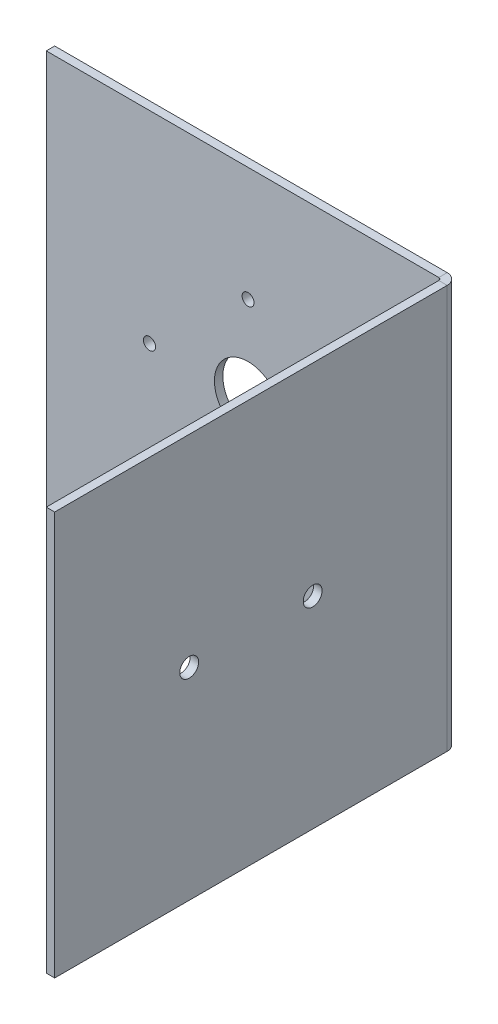
ISO-10303-21;
HEADER;
FILE_DESCRIPTION(('STEP AP214'),'2;1');
FILE_NAME('part.step','',(''),(''),'','','');
FILE_SCHEMA(('AUTOMOTIVE_DESIGN { 1 0 10303 214 1 1 1 1 }'));
ENDSEC;
DATA;
#1=APPLICATION_CONTEXT('core data for automotive mechanical design processes');
#2=APPLICATION_PROTOCOL_DEFINITION('international standard','automotive_design',2000,#1);
#3=PRODUCT_CONTEXT('',#1,'mechanical');
#4=PRODUCT('Part','Part','',(#3));
#5=PRODUCT_RELATED_PRODUCT_CATEGORY('part','',(#4));
#6=PRODUCT_DEFINITION_FORMATION('','',#4);
#7=PRODUCT_DEFINITION_CONTEXT('part definition',#1,'design');
#8=PRODUCT_DEFINITION('design','',#6,#7);
#9=PRODUCT_DEFINITION_SHAPE('','',#8);
#10=(LENGTH_UNIT() NAMED_UNIT(*) SI_UNIT(.MILLI.,.METRE.));
#11=(NAMED_UNIT(*) PLANE_ANGLE_UNIT() SI_UNIT($,.RADIAN.));
#12=(NAMED_UNIT(*) SI_UNIT($,.STERADIAN.) SOLID_ANGLE_UNIT());
#13=UNCERTAINTY_MEASURE_WITH_UNIT(LENGTH_MEASURE(1.E-05),#10,'distance_accuracy_value','');
#14=(GEOMETRIC_REPRESENTATION_CONTEXT(3) GLOBAL_UNCERTAINTY_ASSIGNED_CONTEXT((#13)) GLOBAL_UNIT_ASSIGNED_CONTEXT((#10,
#11,#12)) REPRESENTATION_CONTEXT('',''));
#15=CARTESIAN_POINT('',(0.,0.,0.));
#16=DIRECTION('',(0.,0.,1.));
#17=DIRECTION('',(1.,0.,0.));
#18=AXIS2_PLACEMENT_3D('',#15,#16,#17);
#19=CARTESIAN_POINT('',(0.,76.2,4.175));
#20=DIRECTION('',(0.,1.,0.));
#21=DIRECTION('',(0.,0.,1.));
#22=AXIS2_PLACEMENT_3D('',#19,#20,#21);
#23=PLANE('',#22);
#24=DIRECTION('',(-1.,0.,0.));
#25=VECTOR('',#24,1.);
#26=CARTESIAN_POINT('',(0.,76.2,4.175));
#27=LINE('',#26,#25);
#28=CARTESIAN_POINT('',(0.,76.2,4.175));
#29=VERTEX_POINT('',#28);
#30=CARTESIAN_POINT('',(-3.175,76.2,4.175));
#31=VERTEX_POINT('',#30);
#32=EDGE_CURVE('E11',#29,#31,#27,.T.);
#33=ORIENTED_EDGE('',*,*,#32,.F.);
#34=CARTESIAN_POINT('',(-4.17500000000003,76.2,4.175));
#35=DIRECTION('',(0.,1.,0.));
#36=DIRECTION('',(0.,0.,1.));
#37=AXIS2_PLACEMENT_3D('',#34,#35,#36);
#38=CIRCLE('',#37,4.175);
#39=CARTESIAN_POINT('',(-4.17500000000015,76.2,0.));
#40=VERTEX_POINT('',#39);
#41=EDGE_CURVE('E136',#40,#29,#38,.F.);
#42=ORIENTED_EDGE('',*,*,#41,.F.);
#43=DIRECTION('',(0.,0.,-1.));
#44=VECTOR('',#43,1.);
#45=CARTESIAN_POINT('',(-4.17500000000006,76.2,3.175));
#46=LINE('',#45,#44);
#47=CARTESIAN_POINT('',(-4.17500000000006,76.2,3.175));
#48=VERTEX_POINT('',#47);
#49=EDGE_CURVE('E47',#48,#40,#46,.T.);
#50=ORIENTED_EDGE('',*,*,#49,.F.);
#51=CARTESIAN_POINT('',(-4.17500000000003,76.2,4.175));
#52=DIRECTION('',(0.,1.,0.));
#53=DIRECTION('',(1.,0.,0.));
#54=AXIS2_PLACEMENT_3D('',#51,#52,#53);
#55=CIRCLE('',#54,1.);
#56=EDGE_CURVE('E129',#48,#31,#55,.F.);
#57=ORIENTED_EDGE('',*,*,#56,.T.);
#58=EDGE_LOOP('',(#33,#42,#50,#57));
#59=FACE_BOUND('',#58,.T.);
#60=ADVANCED_FACE('F39',(#59),#23,.T.);
#61=CARTESIAN_POINT('',(-4.17500000000006,76.2,3.175));
#62=DIRECTION('',(0.,1.,0.));
#63=DIRECTION('',(0.,0.,1.));
#64=AXIS2_PLACEMENT_3D('',#61,#62,#63);
#65=PLANE('',#64);
#66=DIRECTION('',(0.,0.,1.));
#67=VECTOR('',#66,1.);
#68=CARTESIAN_POINT('',(0.,76.2,0.));
#69=LINE('',#68,#67);
#70=CARTESIAN_POINT('',(0.,76.2,152.4));
#71=VERTEX_POINT('',#70);
#72=EDGE_CURVE('E186',#29,#71,#69,.T.);
#73=ORIENTED_EDGE('',*,*,#72,.F.);
#74=ORIENTED_EDGE('',*,*,#32,.T.);
#75=DIRECTION('',(0.,0.,1.));
#76=VECTOR('',#75,1.);
#77=CARTESIAN_POINT('',(-3.175,76.2,0.));
#78=LINE('',#77,#76);
#79=CARTESIAN_POINT('',(-3.17499999999998,76.2,152.4));
#80=VERTEX_POINT('',#79);
#81=EDGE_CURVE('E95',#31,#80,#78,.T.);
#82=ORIENTED_EDGE('',*,*,#81,.T.);
#83=DIRECTION('',(-1.,0.,0.));
#84=VECTOR('',#83,1.);
#85=CARTESIAN_POINT('',(0.,76.2,152.4));
#86=LINE('',#85,#84);
#87=EDGE_CURVE('E454',#71,#80,#86,.T.);
#88=ORIENTED_EDGE('',*,*,#87,.F.);
#89=EDGE_LOOP('',(#73,#74,#82,#88));
#90=FACE_BOUND('',#89,.T.);
#91=ADVANCED_FACE('F194',(#90),#65,.T.);
#92=CARTESIAN_POINT('',(-4.17500000000015,-76.2,0.));
#93=DIRECTION('',(0.,-1.,0.));
#94=DIRECTION('',(0.,0.,-1.));
#95=AXIS2_PLACEMENT_3D('',#92,#93,#94);
#96=PLANE('',#95);
#97=DIRECTION('',(0.,0.,1.));
#98=VECTOR('',#97,1.);
#99=CARTESIAN_POINT('',(-4.17500000000015,-76.2,0.));
#100=LINE('',#99,#98);
#101=CARTESIAN_POINT('',(-4.17500000000015,-76.2,0.));
#102=VERTEX_POINT('',#101);
#103=CARTESIAN_POINT('',(-4.17500000000006,-76.2,3.175));
#104=VERTEX_POINT('',#103);
#105=EDGE_CURVE('E82',#102,#104,#100,.T.);
#106=ORIENTED_EDGE('',*,*,#105,.F.);
#107=CARTESIAN_POINT('',(-4.17500000000003,-76.2,4.175));
#108=DIRECTION('',(0.,1.,0.));
#109=DIRECTION('',(0.,0.,1.));
#110=AXIS2_PLACEMENT_3D('',#107,#108,#109);
#111=CIRCLE('',#110,4.175);
#112=CARTESIAN_POINT('',(0.,-76.2,4.175));
#113=VERTEX_POINT('',#112);
#114=EDGE_CURVE('E152',#102,#113,#111,.F.);
#115=ORIENTED_EDGE('',*,*,#114,.T.);
#116=DIRECTION('',(1.,0.,0.));
#117=VECTOR('',#116,1.);
#118=CARTESIAN_POINT('',(-3.175,-76.2,4.175));
#119=LINE('',#118,#117);
#120=CARTESIAN_POINT('',(-3.175,-76.2,4.175));
#121=VERTEX_POINT('',#120);
#122=EDGE_CURVE('E89',#121,#113,#119,.T.);
#123=ORIENTED_EDGE('',*,*,#122,.F.);
#124=CARTESIAN_POINT('',(-4.17500000000003,-76.2,4.175));
#125=DIRECTION('',(0.,1.,0.));
#126=DIRECTION('',(1.,0.,0.));
#127=AXIS2_PLACEMENT_3D('',#124,#125,#126);
#128=CIRCLE('',#127,1.);
#129=EDGE_CURVE('E159',#104,#121,#128,.F.);
#130=ORIENTED_EDGE('',*,*,#129,.F.);
#131=EDGE_LOOP('',(#106,#115,#123,#130));
#132=FACE_BOUND('',#131,.T.);
#133=ADVANCED_FACE('F192',(#132),#96,.T.);
#134=CARTESIAN_POINT('',(-3.175,-76.2,4.175));
#135=DIRECTION('',(0.,-1.,0.));
#136=DIRECTION('',(0.,0.,-1.));
#137=AXIS2_PLACEMENT_3D('',#134,#135,#136);
#138=PLANE('',#137);
#139=DIRECTION('',(1.,0.,0.));
#140=VECTOR('',#139,1.);
#141=CARTESIAN_POINT('',(-152.4,-76.2,0.));
#142=LINE('',#141,#140);
#143=CARTESIAN_POINT('',(-152.4,-76.2,0.));
#144=VERTEX_POINT('',#143);
#145=EDGE_CURVE('E154',#144,#102,#142,.T.);
#146=ORIENTED_EDGE('',*,*,#145,.T.);
#147=ORIENTED_EDGE('',*,*,#105,.T.);
#148=DIRECTION('',(1.,0.,0.));
#149=VECTOR('',#148,1.);
#150=CARTESIAN_POINT('',(-152.4,-76.2,3.175));
#151=LINE('',#150,#149);
#152=CARTESIAN_POINT('',(-152.4,-76.2,3.175));
#153=VERTEX_POINT('',#152);
#154=EDGE_CURVE('E157',#153,#104,#151,.T.);
#155=ORIENTED_EDGE('',*,*,#154,.F.);
#156=DIRECTION('',(0.,0.,-1.));
#157=VECTOR('',#156,1.);
#158=CARTESIAN_POINT('',(-152.4,-76.2,3.175));
#159=LINE('',#158,#157);
#160=EDGE_CURVE('E117',#153,#144,#159,.T.);
#161=ORIENTED_EDGE('',*,*,#160,.T.);
#162=EDGE_LOOP('',(#146,#147,#155,#161));
#163=FACE_BOUND('',#162,.T.);
#164=ADVANCED_FACE('F188',(#163),#138,.T.);
#165=CARTESIAN_POINT('',(-3.175,76.2,0.));
#166=DIRECTION('',(1.,0.,0.));
#167=DIRECTION('',(0.,0.,-1.));
#168=AXIS2_PLACEMENT_3D('',#165,#166,#167);
#169=PLANE('',#168);
#170=CARTESIAN_POINT('',(-3.17500000000004,0.,101.6));
#171=DIRECTION('',(1.,0.,0.));
#172=DIRECTION('',(0.,0.,-1.));
#173=AXIS2_PLACEMENT_3D('',#170,#171,#172);
#174=CIRCLE('',#173,3.55600000000001);
#175=CARTESIAN_POINT('',(-3.17500000000004,0.,98.044));
#176=VERTEX_POINT('',#175);
#177=EDGE_CURVE('E420',#176,#176,#174,.T.);
#178=ORIENTED_EDGE('',*,*,#177,.T.);
#179=EDGE_LOOP('',(#178));
#180=FACE_BOUND('',#179,.T.);
#181=CARTESIAN_POINT('',(-3.17500000000004,0.,54.975));
#182=DIRECTION('',(1.,0.,0.));
#183=DIRECTION('',(0.,0.,-1.));
#184=AXIS2_PLACEMENT_3D('',#181,#182,#183);
#185=CIRCLE('',#184,3.556);
#186=CARTESIAN_POINT('',(-3.17500000000004,0.,51.419));
#187=VERTEX_POINT('',#186);
#188=EDGE_CURVE('E424',#187,#187,#185,.T.);
#189=ORIENTED_EDGE('',*,*,#188,.T.);
#190=EDGE_LOOP('',(#189));
#191=FACE_BOUND('',#190,.T.);
#192=DIRECTION('',(0.,0.,1.));
#193=VECTOR('',#192,1.);
#194=CARTESIAN_POINT('',(-3.175,-76.2,0.));
#195=LINE('',#194,#193);
#196=CARTESIAN_POINT('',(-3.17499999999998,-76.2,152.4));
#197=VERTEX_POINT('',#196);
#198=EDGE_CURVE('E142',#121,#197,#195,.T.);
#199=ORIENTED_EDGE('',*,*,#198,.T.);
#200=DIRECTION('',(0.,-1.,0.));
#201=VECTOR('',#200,1.);
#202=CARTESIAN_POINT('',(-3.17499999999998,76.2,152.4));
#203=LINE('',#202,#201);
#204=EDGE_CURVE('E173',#80,#197,#203,.T.);
#205=ORIENTED_EDGE('',*,*,#204,.F.);
#206=ORIENTED_EDGE('',*,*,#81,.F.);
#207=DIRECTION('',(0.,-1.,0.));
#208=VECTOR('',#207,1.);
#209=CARTESIAN_POINT('',(-3.175,76.2,4.175));
#210=LINE('',#209,#208);
#211=EDGE_CURVE('E141',#31,#121,#210,.T.);
#212=ORIENTED_EDGE('',*,*,#211,.T.);
#213=EDGE_LOOP('',(#199,#205,#206,#212));
#214=FACE_BOUND('',#213,.T.);
#215=ADVANCED_FACE('F200',(#180,#191,#214),#169,.F.);
#216=CARTESIAN_POINT('',(0.,76.2,152.4));
#217=DIRECTION('',(0.,0.,1.));
#218=DIRECTION('',(1.,0.,0.));
#219=AXIS2_PLACEMENT_3D('',#216,#217,#218);
#220=PLANE('',#219);
#221=DIRECTION('',(-1.,0.,0.));
#222=VECTOR('',#221,1.);
#223=CARTESIAN_POINT('',(0.,-76.2,152.4));
#224=LINE('',#223,#222);
#225=CARTESIAN_POINT('',(0.,-76.2,152.4));
#226=VERTEX_POINT('',#225);
#227=EDGE_CURVE('E145',#226,#197,#224,.T.);
#228=ORIENTED_EDGE('',*,*,#227,.F.);
#229=DIRECTION('',(0.,-1.,0.));
#230=VECTOR('',#229,1.);
#231=CARTESIAN_POINT('',(0.,76.2,152.4));
#232=LINE('',#231,#230);
#233=EDGE_CURVE('E171',#71,#226,#232,.T.);
#234=ORIENTED_EDGE('',*,*,#233,.F.);
#235=ORIENTED_EDGE('',*,*,#87,.T.);
#236=ORIENTED_EDGE('',*,*,#204,.T.);
#237=EDGE_LOOP('',(#228,#234,#235,#236));
#238=FACE_BOUND('',#237,.T.);
#239=ADVANCED_FACE('F229',(#238),#220,.T.);
#240=CARTESIAN_POINT('',(0.,76.2,0.));
#241=DIRECTION('',(1.,0.,0.));
#242=DIRECTION('',(0.,0.,-1.));
#243=AXIS2_PLACEMENT_3D('',#240,#241,#242);
#244=PLANE('',#243);
#245=CARTESIAN_POINT('',(0.,0.,101.6));
#246=DIRECTION('',(1.,0.,0.));
#247=DIRECTION('',(0.,0.,1.));
#248=AXIS2_PLACEMENT_3D('',#245,#246,#247);
#249=CIRCLE('',#248,3.55600000000001);
#250=CARTESIAN_POINT('',(0.,0.,105.156));
#251=VERTEX_POINT('',#250);
#252=EDGE_CURVE('E417',#251,#251,#249,.T.);
#253=ORIENTED_EDGE('',*,*,#252,.F.);
#254=EDGE_LOOP('',(#253));
#255=FACE_BOUND('',#254,.T.);
#256=CARTESIAN_POINT('',(0.,0.,54.975));
#257=DIRECTION('',(1.,0.,0.));
#258=DIRECTION('',(0.,0.,-1.));
#259=AXIS2_PLACEMENT_3D('',#256,#257,#258);
#260=CIRCLE('',#259,3.556);
#261=CARTESIAN_POINT('',(0.,0.,51.419));
#262=VERTEX_POINT('',#261);
#263=EDGE_CURVE('E421',#262,#262,#260,.T.);
#264=ORIENTED_EDGE('',*,*,#263,.F.);
#265=EDGE_LOOP('',(#264));
#266=FACE_BOUND('',#265,.T.);
#267=DIRECTION('',(0.,0.,1.));
#268=VECTOR('',#267,1.);
#269=CARTESIAN_POINT('',(0.,-76.2,0.));
#270=LINE('',#269,#268);
#271=EDGE_CURVE('E149',#113,#226,#270,.T.);
#272=ORIENTED_EDGE('',*,*,#271,.F.);
#273=DIRECTION('',(0.,-1.,0.));
#274=VECTOR('',#273,1.);
#275=CARTESIAN_POINT('',(0.,76.2,4.175));
#276=LINE('',#275,#274);
#277=EDGE_CURVE('E168',#29,#113,#276,.T.);
#278=ORIENTED_EDGE('',*,*,#277,.F.);
#279=ORIENTED_EDGE('',*,*,#72,.T.);
#280=ORIENTED_EDGE('',*,*,#233,.T.);
#281=EDGE_LOOP('',(#272,#278,#279,#280));
#282=FACE_BOUND('',#281,.T.);
#283=ADVANCED_FACE('F234',(#255,#266,#282),#244,.T.);
#284=CARTESIAN_POINT('',(-4.17500000000003,76.2,4.175));
#285=DIRECTION('',(0.,-1.,0.));
#286=DIRECTION('',(0.,0.,-1.));
#287=AXIS2_PLACEMENT_3D('',#284,#285,#286);
#288=CYLINDRICAL_SURFACE('',#287,4.175);
#289=ORIENTED_EDGE('',*,*,#114,.F.);
#290=DIRECTION('',(0.,-1.,0.));
#291=VECTOR('',#290,1.);
#292=CARTESIAN_POINT('',(-4.17500000000015,76.2,0.));
#293=LINE('',#292,#291);
#294=EDGE_CURVE('E165',#40,#102,#293,.T.);
#295=ORIENTED_EDGE('',*,*,#294,.F.);
#296=ORIENTED_EDGE('',*,*,#41,.T.);
#297=ORIENTED_EDGE('',*,*,#277,.T.);
#298=EDGE_LOOP('',(#289,#295,#296,#297));
#299=FACE_BOUND('',#298,.T.);
#300=ADVANCED_FACE('F182',(#299),#288,.T.);
#301=CARTESIAN_POINT('',(-152.4,76.2,0.));
#302=DIRECTION('',(0.,0.,-1.));
#303=DIRECTION('',(-1.,0.,0.));
#304=AXIS2_PLACEMENT_3D('',#301,#302,#303);
#305=PLANE('',#304);
#306=CARTESIAN_POINT('',(-113.423619839559,0.,0.));
#307=DIRECTION('',(0.,0.,1.));
#308=DIRECTION('',(1.,0.,0.));
#309=AXIS2_PLACEMENT_3D('',#306,#307,#308);
#310=CIRCLE('',#309,2.28599999999999);
#311=CARTESIAN_POINT('',(-111.137619839559,0.,0.));
#312=VERTEX_POINT('',#311);
#313=EDGE_CURVE('E431',#312,#312,#310,.T.);
#314=ORIENTED_EDGE('',*,*,#313,.T.);
#315=EDGE_LOOP('',(#314));
#316=FACE_BOUND('',#315,.T.);
#317=CARTESIAN_POINT('',(-76.2,-33.02,0.));
#318=DIRECTION('',(0.,0.,1.));
#319=DIRECTION('',(-1.,0.,0.));
#320=AXIS2_PLACEMENT_3D('',#317,#318,#319);
#321=CIRCLE('',#320,2.26060000000001);
#322=CARTESIAN_POINT('',(-78.4606,-33.02,0.));
#323=VERTEX_POINT('',#322);
#324=EDGE_CURVE('E437',#323,#323,#321,.T.);
#325=ORIENTED_EDGE('',*,*,#324,.T.);
#326=EDGE_LOOP('',(#325));
#327=FACE_BOUND('',#326,.T.);
#328=CARTESIAN_POINT('',(-76.2,33.02,0.));
#329=DIRECTION('',(0.,0.,1.));
#330=DIRECTION('',(1.,0.,0.));
#331=AXIS2_PLACEMENT_3D('',#328,#329,#330);
#332=CIRCLE('',#331,2.26060000000001);
#333=CARTESIAN_POINT('',(-73.9394,33.02,0.));
#334=VERTEX_POINT('',#333);
#335=EDGE_CURVE('E443',#334,#334,#332,.T.);
#336=ORIENTED_EDGE('',*,*,#335,.T.);
#337=EDGE_LOOP('',(#336));
#338=FACE_BOUND('',#337,.T.);
#339=CARTESIAN_POINT('',(-76.2,0.,0.));
#340=DIRECTION('',(0.,0.,1.));
#341=DIRECTION('',(1.,0.,0.));
#342=AXIS2_PLACEMENT_3D('',#339,#340,#341);
#343=CIRCLE('',#342,12.7);
#344=CARTESIAN_POINT('',(-63.5,0.,0.));
#345=VERTEX_POINT('',#344);
#346=EDGE_CURVE('E146',#345,#345,#343,.T.);
#347=ORIENTED_EDGE('',*,*,#346,.T.);
#348=EDGE_LOOP('',(#347));
#349=FACE_BOUND('',#348,.T.);
#350=ORIENTED_EDGE('',*,*,#145,.F.);
#351=DIRECTION('',(0.,-1.,0.));
#352=VECTOR('',#351,1.);
#353=CARTESIAN_POINT('',(-152.4,76.2,0.));
#354=LINE('',#353,#352);
#355=CARTESIAN_POINT('',(-152.4,76.2,0.));
#356=VERTEX_POINT('',#355);
#357=EDGE_CURVE('E119',#356,#144,#354,.T.);
#358=ORIENTED_EDGE('',*,*,#357,.F.);
#359=DIRECTION('',(1.,0.,0.));
#360=VECTOR('',#359,1.);
#361=CARTESIAN_POINT('',(-152.4,76.2,0.));
#362=LINE('',#361,#360);
#363=EDGE_CURVE('E134',#356,#40,#362,.T.);
#364=ORIENTED_EDGE('',*,*,#363,.T.);
#365=ORIENTED_EDGE('',*,*,#294,.T.);
#366=EDGE_LOOP('',(#350,#358,#364,#365));
#367=FACE_BOUND('',#366,.T.);
#368=ADVANCED_FACE('F187',(#316,#327,#338,#349,#367),#305,.T.);
#369=CARTESIAN_POINT('',(-152.4,76.2,3.175));
#370=DIRECTION('',(-1.,0.,0.));
#371=DIRECTION('',(0.,0.,1.));
#372=AXIS2_PLACEMENT_3D('',#369,#370,#371);
#373=PLANE('',#372);
#374=ORIENTED_EDGE('',*,*,#160,.F.);
#375=DIRECTION('',(0.,-1.,0.));
#376=VECTOR('',#375,1.);
#377=CARTESIAN_POINT('',(-152.4,76.2,3.175));
#378=LINE('',#377,#376);
#379=CARTESIAN_POINT('',(-152.4,76.2,3.175));
#380=VERTEX_POINT('',#379);
#381=EDGE_CURVE('E111',#380,#153,#378,.T.);
#382=ORIENTED_EDGE('',*,*,#381,.F.);
#383=DIRECTION('',(0.,0.,-1.));
#384=VECTOR('',#383,1.);
#385=CARTESIAN_POINT('',(-152.4,76.2,3.175));
#386=LINE('',#385,#384);
#387=EDGE_CURVE('E115',#380,#356,#386,.T.);
#388=ORIENTED_EDGE('',*,*,#387,.T.);
#389=ORIENTED_EDGE('',*,*,#357,.T.);
#390=EDGE_LOOP('',(#374,#382,#388,#389));
#391=FACE_BOUND('',#390,.T.);
#392=ADVANCED_FACE('F113',(#391),#373,.T.);
#393=CARTESIAN_POINT('',(-152.4,76.2,3.175));
#394=DIRECTION('',(0.,0.,-1.));
#395=DIRECTION('',(-1.,0.,0.));
#396=AXIS2_PLACEMENT_3D('',#393,#394,#395);
#397=PLANE('',#396);
#398=CARTESIAN_POINT('',(-113.423619839559,0.,3.175));
#399=DIRECTION('',(0.,0.,1.));
#400=DIRECTION('',(1.,0.,0.));
#401=AXIS2_PLACEMENT_3D('',#398,#399,#400);
#402=CIRCLE('',#401,2.28599999999999);
#403=CARTESIAN_POINT('',(-111.137619839559,0.,3.175));
#404=VERTEX_POINT('',#403);
#405=EDGE_CURVE('E430',#404,#404,#402,.T.);
#406=ORIENTED_EDGE('',*,*,#405,.F.);
#407=EDGE_LOOP('',(#406));
#408=FACE_BOUND('',#407,.T.);
#409=CARTESIAN_POINT('',(-76.2,-33.02,3.175));
#410=DIRECTION('',(0.,0.,1.));
#411=DIRECTION('',(-1.,0.,0.));
#412=AXIS2_PLACEMENT_3D('',#409,#410,#411);
#413=CIRCLE('',#412,2.26060000000001);
#414=CARTESIAN_POINT('',(-78.4606,-33.02,3.175));
#415=VERTEX_POINT('',#414);
#416=EDGE_CURVE('E434',#415,#415,#413,.T.);
#417=ORIENTED_EDGE('',*,*,#416,.F.);
#418=EDGE_LOOP('',(#417));
#419=FACE_BOUND('',#418,.T.);
#420=CARTESIAN_POINT('',(-76.2,33.02,3.175));
#421=DIRECTION('',(0.,0.,1.));
#422=DIRECTION('',(1.,0.,0.));
#423=AXIS2_PLACEMENT_3D('',#420,#421,#422);
#424=CIRCLE('',#423,2.26060000000001);
#425=CARTESIAN_POINT('',(-73.9394,33.02,3.175));
#426=VERTEX_POINT('',#425);
#427=EDGE_CURVE('E440',#426,#426,#424,.T.);
#428=ORIENTED_EDGE('',*,*,#427,.F.);
#429=EDGE_LOOP('',(#428));
#430=FACE_BOUND('',#429,.T.);
#431=CARTESIAN_POINT('',(-76.2,0.,3.175));
#432=DIRECTION('',(0.,0.,1.));
#433=DIRECTION('',(1.,0.,0.));
#434=AXIS2_PLACEMENT_3D('',#431,#432,#433);
#435=CIRCLE('',#434,12.7);
#436=CARTESIAN_POINT('',(-63.5,0.,3.175));
#437=VERTEX_POINT('',#436);
#438=EDGE_CURVE('E446',#437,#437,#435,.T.);
#439=ORIENTED_EDGE('',*,*,#438,.F.);
#440=EDGE_LOOP('',(#439));
#441=FACE_BOUND('',#440,.T.);
#442=ORIENTED_EDGE('',*,*,#154,.T.);
#443=DIRECTION('',(0.,-1.,0.));
#444=VECTOR('',#443,1.);
#445=CARTESIAN_POINT('',(-4.17500000000006,76.2,3.175));
#446=LINE('',#445,#444);
#447=EDGE_CURVE('E120',#48,#104,#446,.T.);
#448=ORIENTED_EDGE('',*,*,#447,.F.);
#449=DIRECTION('',(1.,0.,0.));
#450=VECTOR('',#449,1.);
#451=CARTESIAN_POINT('',(-152.4,76.2,3.175));
#452=LINE('',#451,#450);
#453=EDGE_CURVE('E124',#380,#48,#452,.T.);
#454=ORIENTED_EDGE('',*,*,#453,.F.);
#455=ORIENTED_EDGE('',*,*,#381,.T.);
#456=EDGE_LOOP('',(#442,#448,#454,#455));
#457=FACE_BOUND('',#456,.T.);
#458=ADVANCED_FACE('F125',(#408,#419,#430,#441,#457),#397,.F.);
#459=CARTESIAN_POINT('',(-4.17500000000003,76.2,4.175));
#460=DIRECTION('',(0.,-1.,0.));
#461=DIRECTION('',(0.,0.,-1.));
#462=AXIS2_PLACEMENT_3D('',#459,#460,#461);
#463=CYLINDRICAL_SURFACE('',#462,1.);
#464=ORIENTED_EDGE('',*,*,#129,.T.);
#465=ORIENTED_EDGE('',*,*,#211,.F.);
#466=ORIENTED_EDGE('',*,*,#56,.F.);
#467=ORIENTED_EDGE('',*,*,#447,.T.);
#468=EDGE_LOOP('',(#464,#465,#466,#467));
#469=FACE_BOUND('',#468,.T.);
#470=ADVANCED_FACE('F190',(#469),#463,.F.);
#471=CARTESIAN_POINT('',(-4.17500000000003,76.2,4.175));
#472=DIRECTION('',(0.,1.,0.));
#473=DIRECTION('',(1.,0.,0.));
#474=AXIS2_PLACEMENT_3D('',#471,#472,#473);
#475=PLANE('',#474);
#476=ORIENTED_EDGE('',*,*,#453,.T.);
#477=ORIENTED_EDGE('',*,*,#49,.T.);
#478=ORIENTED_EDGE('',*,*,#363,.F.);
#479=ORIENTED_EDGE('',*,*,#387,.F.);
#480=EDGE_LOOP('',(#476,#477,#478,#479));
#481=FACE_BOUND('',#480,.T.);
#482=ADVANCED_FACE('F132',(#481),#475,.T.);
#483=CARTESIAN_POINT('',(-4.17500000000003,-76.2,4.175));
#484=DIRECTION('',(0.,1.,0.));
#485=DIRECTION('',(1.,0.,0.));
#486=AXIS2_PLACEMENT_3D('',#483,#484,#485);
#487=PLANE('',#486);
#488=ORIENTED_EDGE('',*,*,#198,.F.);
#489=ORIENTED_EDGE('',*,*,#122,.T.);
#490=ORIENTED_EDGE('',*,*,#271,.T.);
#491=ORIENTED_EDGE('',*,*,#227,.T.);
#492=EDGE_LOOP('',(#488,#489,#490,#491));
#493=FACE_BOUND('',#492,.T.);
#494=ADVANCED_FACE('F278',(#493),#487,.F.);
#495=CARTESIAN_POINT('',(-76.2,0.,0.));
#496=DIRECTION('',(0.,0.,1.));
#497=DIRECTION('',(1.,0.,0.));
#498=AXIS2_PLACEMENT_3D('',#495,#496,#497);
#499=CYLINDRICAL_SURFACE('',#498,12.7);
#500=ORIENTED_EDGE('',*,*,#346,.F.);
#501=EDGE_LOOP('',(#500));
#502=FACE_BOUND('',#501,.T.);
#503=ORIENTED_EDGE('',*,*,#438,.T.);
#504=EDGE_LOOP('',(#503));
#505=FACE_BOUND('',#504,.T.);
#506=ADVANCED_FACE('F288',(#502,#505),#499,.F.);
#507=CARTESIAN_POINT('',(-76.2,33.02,0.));
#508=DIRECTION('',(0.,0.,1.));
#509=DIRECTION('',(1.,0.,0.));
#510=AXIS2_PLACEMENT_3D('',#507,#508,#509);
#511=CYLINDRICAL_SURFACE('',#510,2.26060000000001);
#512=ORIENTED_EDGE('',*,*,#335,.F.);
#513=EDGE_LOOP('',(#512));
#514=FACE_BOUND('',#513,.T.);
#515=ORIENTED_EDGE('',*,*,#427,.T.);
#516=EDGE_LOOP('',(#515));
#517=FACE_BOUND('',#516,.T.);
#518=ADVANCED_FACE('F299',(#514,#517),#511,.F.);
#519=CARTESIAN_POINT('',(-76.2,-33.02,0.));
#520=DIRECTION('',(0.,0.,1.));
#521=DIRECTION('',(1.,0.,0.));
#522=AXIS2_PLACEMENT_3D('',#519,#520,#521);
#523=CYLINDRICAL_SURFACE('',#522,2.26060000000001);
#524=ORIENTED_EDGE('',*,*,#324,.F.);
#525=EDGE_LOOP('',(#524));
#526=FACE_BOUND('',#525,.T.);
#527=ORIENTED_EDGE('',*,*,#416,.T.);
#528=EDGE_LOOP('',(#527));
#529=FACE_BOUND('',#528,.T.);
#530=ADVANCED_FACE('F310',(#526,#529),#523,.F.);
#531=CARTESIAN_POINT('',(-113.423619839559,0.,0.));
#532=DIRECTION('',(0.,0.,1.));
#533=DIRECTION('',(1.,0.,0.));
#534=AXIS2_PLACEMENT_3D('',#531,#532,#533);
#535=CYLINDRICAL_SURFACE('',#534,2.28599999999999);
#536=ORIENTED_EDGE('',*,*,#313,.F.);
#537=EDGE_LOOP('',(#536));
#538=FACE_BOUND('',#537,.T.);
#539=ORIENTED_EDGE('',*,*,#405,.T.);
#540=EDGE_LOOP('',(#539));
#541=FACE_BOUND('',#540,.T.);
#542=ADVANCED_FACE('F321',(#538,#541),#535,.F.);
#543=CARTESIAN_POINT('',(-152.4,0.,54.975));
#544=DIRECTION('',(1.,0.,0.));
#545=DIRECTION('',(0.,0.,-1.));
#546=AXIS2_PLACEMENT_3D('',#543,#544,#545);
#547=CYLINDRICAL_SURFACE('',#546,3.556);
#548=ORIENTED_EDGE('',*,*,#263,.T.);
#549=EDGE_LOOP('',(#548));
#550=FACE_BOUND('',#549,.T.);
#551=ORIENTED_EDGE('',*,*,#188,.F.);
#552=EDGE_LOOP('',(#551));
#553=FACE_BOUND('',#552,.T.);
#554=ADVANCED_FACE('F348',(#550,#553),#547,.F.);
#555=CARTESIAN_POINT('',(-152.4,0.,101.6));
#556=DIRECTION('',(1.,0.,0.));
#557=DIRECTION('',(0.,0.,-1.));
#558=AXIS2_PLACEMENT_3D('',#555,#556,#557);
#559=CYLINDRICAL_SURFACE('',#558,3.55600000000001);
#560=ORIENTED_EDGE('',*,*,#252,.T.);
#561=EDGE_LOOP('',(#560));
#562=FACE_BOUND('',#561,.T.);
#563=ORIENTED_EDGE('',*,*,#177,.F.);
#564=EDGE_LOOP('',(#563));
#565=FACE_BOUND('',#564,.T.);
#566=ADVANCED_FACE('F375',(#562,#565),#559,.F.);
#567=CLOSED_SHELL('',(#60,#91,#133,#164,#215,#239,#283,#300,#368,#392,#458,#470,#482,#494,#506,
#518,#530,#542,#554,#566));
#568=MANIFOLD_SOLID_BREP('B2',#567);
#569=ADVANCED_BREP_SHAPE_REPRESENTATION('',(#18,#568),#14);
#570=SHAPE_DEFINITION_REPRESENTATION(#9,#569);
ENDSEC;
END-ISO-10303-21;
